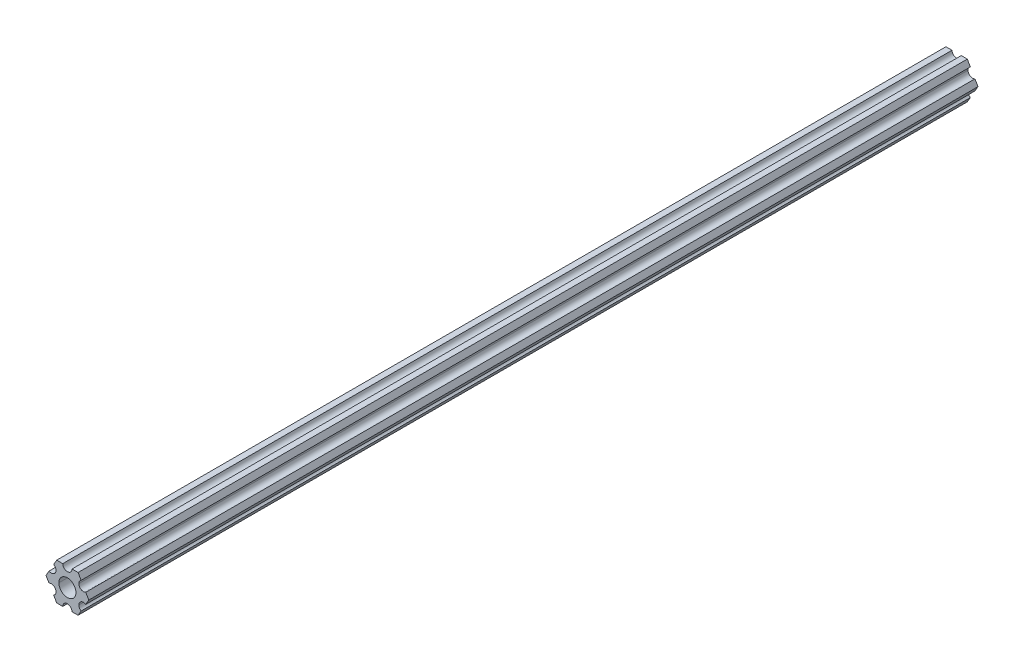
ISO-10303-21;
HEADER;
FILE_DESCRIPTION(('STEP AP214'),'2;1');
FILE_NAME('part.step','',(''),(''),'','','');
FILE_SCHEMA(('AUTOMOTIVE_DESIGN { 1 0 10303 214 1 1 1 1 }'));
ENDSEC;
DATA;
#1=APPLICATION_CONTEXT('core data for automotive mechanical design processes');
#2=APPLICATION_PROTOCOL_DEFINITION('international standard','automotive_design',2000,#1);
#3=PRODUCT_CONTEXT('',#1,'mechanical');
#4=PRODUCT('Part','Part','',(#3));
#5=PRODUCT_RELATED_PRODUCT_CATEGORY('part','',(#4));
#6=PRODUCT_DEFINITION_FORMATION('','',#4);
#7=PRODUCT_DEFINITION_CONTEXT('part definition',#1,'design');
#8=PRODUCT_DEFINITION('design','',#6,#7);
#9=PRODUCT_DEFINITION_SHAPE('','',#8);
#10=(LENGTH_UNIT() NAMED_UNIT(*) SI_UNIT(.MILLI.,.METRE.));
#11=(NAMED_UNIT(*) PLANE_ANGLE_UNIT() SI_UNIT($,.RADIAN.));
#12=(NAMED_UNIT(*) SI_UNIT($,.STERADIAN.) SOLID_ANGLE_UNIT());
#13=UNCERTAINTY_MEASURE_WITH_UNIT(LENGTH_MEASURE(1.E-05),#10,'distance_accuracy_value','');
#14=(GEOMETRIC_REPRESENTATION_CONTEXT(3) GLOBAL_UNCERTAINTY_ASSIGNED_CONTEXT((#13)) GLOBAL_UNIT_ASSIGNED_CONTEXT((#10,
#11,#12)) REPRESENTATION_CONTEXT('',''));
#15=CARTESIAN_POINT('',(0.,0.,0.));
#16=DIRECTION('',(0.,0.,1.));
#17=DIRECTION('',(1.,0.,0.));
#18=AXIS2_PLACEMENT_3D('',#15,#16,#17);
#19=CARTESIAN_POINT('',(0.,0.,304.8));
#20=DIRECTION('',(0.,0.,-1.));
#21=DIRECTION('',(-1.,0.,0.));
#22=AXIS2_PLACEMENT_3D('',#19,#20,#21);
#23=CYLINDRICAL_SURFACE('',#22,2.9337);
#24=DIRECTION('',(0.,0.,-1.));
#25=VECTOR('',#24,1.);
#26=CARTESIAN_POINT('',(2.9337,0.,304.8));
#27=LINE('',#26,#25);
#28=CARTESIAN_POINT('',(2.9337,0.,304.8));
#29=VERTEX_POINT('',#28);
#30=CARTESIAN_POINT('',(2.9337,0.,0.));
#31=VERTEX_POINT('',#30);
#32=EDGE_CURVE('E354',#29,#31,#27,.T.);
#33=ORIENTED_EDGE('',*,*,#32,.F.);
#34=CARTESIAN_POINT('',(0.,0.,304.8));
#35=DIRECTION('',(0.,0.,1.));
#36=DIRECTION('',(1.,0.,0.));
#37=AXIS2_PLACEMENT_3D('',#34,#35,#36);
#38=CIRCLE('',#37,2.9337);
#39=CARTESIAN_POINT('',(-2.9337,0.,304.8));
#40=VERTEX_POINT('',#39);
#41=EDGE_CURVE('E159',#29,#40,#38,.T.);
#42=ORIENTED_EDGE('',*,*,#41,.T.);
#43=DIRECTION('',(0.,0.,-1.));
#44=VECTOR('',#43,1.);
#45=CARTESIAN_POINT('',(-2.9337,0.,304.8));
#46=LINE('',#45,#44);
#47=CARTESIAN_POINT('',(-2.9337,0.,0.));
#48=VERTEX_POINT('',#47);
#49=EDGE_CURVE('E194',#40,#48,#46,.T.);
#50=ORIENTED_EDGE('',*,*,#49,.T.);
#51=CARTESIAN_POINT('',(0.,0.,0.));
#52=DIRECTION('',(0.,0.,1.));
#53=DIRECTION('',(1.,0.,0.));
#54=AXIS2_PLACEMENT_3D('',#51,#52,#53);
#55=CIRCLE('',#54,2.9337);
#56=EDGE_CURVE('E141',#31,#48,#55,.T.);
#57=ORIENTED_EDGE('',*,*,#56,.F.);
#58=EDGE_LOOP('',(#33,#42,#50,#57));
#59=FACE_BOUND('',#58,.T.);
#60=ADVANCED_FACE('F16',(#59),#23,.F.);
#61=CARTESIAN_POINT('',(5.49926150638082,-3.17499966684067,304.8));
#62=DIRECTION('',(0.,0.,-1.));
#63=DIRECTION('',(-1.,0.,0.));
#64=AXIS2_PLACEMENT_3D('',#61,#62,#63);
#65=CYLINDRICAL_SURFACE('',#64,1.5875);
#66=DIRECTION('',(0.,0.,-1.));
#67=VECTOR('',#66,1.);
#68=CARTESIAN_POINT('',(3.91176150638082,-3.17499966684067,304.8));
#69=LINE('',#68,#67);
#70=CARTESIAN_POINT('',(3.91176150638082,-3.17499966684067,304.8));
#71=VERTEX_POINT('',#70);
#72=CARTESIAN_POINT('',(3.91176150638082,-3.17499966684067,0.));
#73=VERTEX_POINT('',#72);
#74=EDGE_CURVE('E204',#71,#73,#69,.T.);
#75=ORIENTED_EDGE('',*,*,#74,.F.);
#76=CARTESIAN_POINT('',(5.49926150638082,-3.17499966684067,304.8));
#77=DIRECTION('',(0.,0.,-1.));
#78=DIRECTION('',(1.,0.,0.));
#79=AXIS2_PLACEMENT_3D('',#76,#77,#78);
#80=CIRCLE('',#79,1.5875);
#81=CARTESIAN_POINT('',(4.70551158967065,-4.54981504343587,304.8));
#82=VERTEX_POINT('',#81);
#83=EDGE_CURVE('E168',#82,#71,#80,.T.);
#84=ORIENTED_EDGE('',*,*,#83,.F.);
#85=DIRECTION('',(0.,0.,-1.));
#86=VECTOR('',#85,1.);
#87=CARTESIAN_POINT('',(4.70551158967065,-4.54981504343587,304.8));
#88=LINE('',#87,#86);
#89=CARTESIAN_POINT('',(4.70551158967065,-4.54981504343587,0.));
#90=VERTEX_POINT('',#89);
#91=EDGE_CURVE('E11',#82,#90,#88,.T.);
#92=ORIENTED_EDGE('',*,*,#91,.T.);
#93=CARTESIAN_POINT('',(5.49926150638082,-3.17499966684067,0.));
#94=DIRECTION('',(0.,0.,-1.));
#95=DIRECTION('',(1.,0.,0.));
#96=AXIS2_PLACEMENT_3D('',#93,#94,#95);
#97=CIRCLE('',#96,1.5875);
#98=EDGE_CURVE('E158',#90,#73,#97,.T.);
#99=ORIENTED_EDGE('',*,*,#98,.T.);
#100=EDGE_LOOP('',(#75,#84,#92,#99));
#101=FACE_BOUND('',#100,.T.);
#102=ADVANCED_FACE('F485',(#101),#65,.F.);
#103=CARTESIAN_POINT('',(3.66617459405346,-6.34999977789375,304.8));
#104=DIRECTION('',(-0.86602543407573,0.499999947533941,0.));
#105=DIRECTION('',(0.,0.,1.));
#106=AXIS2_PLACEMENT_3D('',#103,#104,#105);
#107=PLANE('',#106);
#108=DIRECTION('',(0.499999947533941,0.86602543407573,0.));
#109=VECTOR('',#108,1.);
#110=CARTESIAN_POINT('',(3.66617459405346,-6.34999977789375,0.));
#111=LINE('',#110,#109);
#112=CARTESIAN_POINT('',(3.66617459405346,-6.34999977789375,0.));
#113=VERTEX_POINT('',#112);
#114=EDGE_CURVE('E165',#113,#90,#111,.T.);
#115=ORIENTED_EDGE('',*,*,#114,.T.);
#116=ORIENTED_EDGE('',*,*,#91,.F.);
#117=DIRECTION('',(0.499999947533941,0.86602543407573,0.));
#118=VECTOR('',#117,1.);
#119=CARTESIAN_POINT('',(3.66617459405346,-6.34999977789375,304.8));
#120=LINE('',#119,#118);
#121=CARTESIAN_POINT('',(3.66617459405346,-6.34999977789375,304.8));
#122=VERTEX_POINT('',#121);
#123=EDGE_CURVE('E244',#122,#82,#120,.T.);
#124=ORIENTED_EDGE('',*,*,#123,.F.);
#125=DIRECTION('',(0.,0.,-1.));
#126=VECTOR('',#125,1.);
#127=CARTESIAN_POINT('',(3.66617459405346,-6.34999977789375,304.8));
#128=LINE('',#127,#126);
#129=EDGE_CURVE('E27',#122,#113,#128,.T.);
#130=ORIENTED_EDGE('',*,*,#129,.T.);
#131=EDGE_LOOP('',(#115,#116,#124,#130));
#132=FACE_BOUND('',#131,.T.);
#133=ADVANCED_FACE('F489',(#132),#107,.F.);
#134=CARTESIAN_POINT('',(1.58750038469926,-6.34999990382518,304.8));
#135=DIRECTION('',(-6.05825721258438E-08,1.,0.));
#136=DIRECTION('',(0.,0.,1.));
#137=AXIS2_PLACEMENT_3D('',#134,#135,#136);
#138=PLANE('',#137);
#139=DIRECTION('',(1.,6.05825721258438E-08,0.));
#140=VECTOR('',#139,1.);
#141=CARTESIAN_POINT('',(1.58750038469926,-6.34999990382518,0.));
#142=LINE('',#141,#140);
#143=CARTESIAN_POINT('',(1.58750038469926,-6.34999990382518,0.));
#144=VERTEX_POINT('',#143);
#145=EDGE_CURVE('E171',#144,#113,#142,.T.);
#146=ORIENTED_EDGE('',*,*,#145,.T.);
#147=ORIENTED_EDGE('',*,*,#129,.F.);
#148=DIRECTION('',(1.,6.05825721258438E-08,0.));
#149=VECTOR('',#148,1.);
#150=CARTESIAN_POINT('',(1.58750038469926,-6.34999990382518,304.8));
#151=LINE('',#150,#149);
#152=CARTESIAN_POINT('',(1.58750038469926,-6.34999990382518,304.8));
#153=VERTEX_POINT('',#152);
#154=EDGE_CURVE('E240',#153,#122,#151,.T.);
#155=ORIENTED_EDGE('',*,*,#154,.F.);
#156=DIRECTION('',(0.,0.,-1.));
#157=VECTOR('',#156,1.);
#158=CARTESIAN_POINT('',(1.58750038469926,-6.34999990382518,304.8));
#159=LINE('',#158,#157);
#160=EDGE_CURVE('E202',#153,#144,#159,.T.);
#161=ORIENTED_EDGE('',*,*,#160,.T.);
#162=EDGE_LOOP('',(#146,#147,#155,#161));
#163=FACE_BOUND('',#162,.T.);
#164=ADVANCED_FACE('F492',(#163),#138,.F.);
#165=CARTESIAN_POINT('',(3.8469926204343E-07,-6.35,304.8));
#166=DIRECTION('',(0.,0.,-1.));
#167=DIRECTION('',(-1.,0.,0.));
#168=AXIS2_PLACEMENT_3D('',#165,#166,#167);
#169=CYLINDRICAL_SURFACE('',#168,1.5875);
#170=CARTESIAN_POINT('',(3.8469926204343E-07,-6.35,0.));
#171=DIRECTION('',(0.,0.,-1.));
#172=DIRECTION('',(1.,0.,0.));
#173=AXIS2_PLACEMENT_3D('',#170,#171,#172);
#174=CIRCLE('',#173,1.5875);
#175=CARTESIAN_POINT('',(-1.58749961530073,-6.35000009617482,0.));
#176=VERTEX_POINT('',#175);
#177=EDGE_CURVE('E175',#176,#144,#174,.T.);
#178=ORIENTED_EDGE('',*,*,#177,.T.);
#179=ORIENTED_EDGE('',*,*,#160,.F.);
#180=CARTESIAN_POINT('',(3.8469926204343E-07,-6.35,304.8));
#181=DIRECTION('',(0.,0.,-1.));
#182=DIRECTION('',(1.,0.,0.));
#183=AXIS2_PLACEMENT_3D('',#180,#181,#182);
#184=CIRCLE('',#183,1.5875);
#185=CARTESIAN_POINT('',(-1.58749961530073,-6.35000009617482,304.8));
#186=VERTEX_POINT('',#185);
#187=EDGE_CURVE('E245',#186,#153,#184,.T.);
#188=ORIENTED_EDGE('',*,*,#187,.F.);
#189=DIRECTION('',(0.,0.,-1.));
#190=VECTOR('',#189,1.);
#191=CARTESIAN_POINT('',(-1.58749961530073,-6.35000009617482,304.8));
#192=LINE('',#191,#190);
#193=EDGE_CURVE('E254',#186,#176,#192,.T.);
#194=ORIENTED_EDGE('',*,*,#193,.T.);
#195=EDGE_LOOP('',(#178,#179,#188,#194));
#196=FACE_BOUND('',#195,.T.);
#197=ADVANCED_FACE('F497',(#196),#169,.F.);
#198=CARTESIAN_POINT('',(-3.66617382465481,-6.35000022210628,304.8));
#199=DIRECTION('',(-6.05825854783851E-08,1.,0.));
#200=DIRECTION('',(0.,0.,1.));
#201=AXIS2_PLACEMENT_3D('',#198,#199,#200);
#202=PLANE('',#201);
#203=DIRECTION('',(1.,6.05825854783851E-08,0.));
#204=VECTOR('',#203,1.);
#205=CARTESIAN_POINT('',(-3.66617382465481,-6.35000022210628,0.));
#206=LINE('',#205,#204);
#207=CARTESIAN_POINT('',(-3.66617382465481,-6.35000022210628,0.));
#208=VERTEX_POINT('',#207);
#209=EDGE_CURVE('E266',#208,#176,#206,.T.);
#210=ORIENTED_EDGE('',*,*,#209,.T.);
#211=ORIENTED_EDGE('',*,*,#193,.F.);
#212=DIRECTION('',(1.,6.05825854783851E-08,0.));
#213=VECTOR('',#212,1.);
#214=CARTESIAN_POINT('',(-3.66617382465481,-6.35000022210628,304.8));
#215=LINE('',#214,#213);
#216=CARTESIAN_POINT('',(-3.66617382465481,-6.35000022210628,304.8));
#217=VERTEX_POINT('',#216);
#218=EDGE_CURVE('E250',#217,#186,#215,.T.);
#219=ORIENTED_EDGE('',*,*,#218,.F.);
#220=DIRECTION('',(0.,0.,-1.));
#221=VECTOR('',#220,1.);
#222=CARTESIAN_POINT('',(-3.66617382465481,-6.35000022210628,304.8));
#223=LINE('',#222,#221);
#224=EDGE_CURVE('E258',#217,#208,#223,.T.);
#225=ORIENTED_EDGE('',*,*,#224,.T.);
#226=EDGE_LOOP('',(#210,#211,#219,#225));
#227=FACE_BOUND('',#226,.T.);
#228=ADVANCED_FACE('F502',(#227),#202,.F.);
#229=CARTESIAN_POINT('',(-4.70551103839172,-4.54981561357972,304.8));
#230=DIRECTION('',(0.866025373493152,0.500000052466045,0.));
#231=DIRECTION('',(0.,0.,-1.));
#232=AXIS2_PLACEMENT_3D('',#229,#230,#231);
#233=PLANE('',#232);
#234=DIRECTION('',(0.500000052466045,-0.866025373493152,0.));
#235=VECTOR('',#234,1.);
#236=CARTESIAN_POINT('',(-4.70551103839172,-4.54981561357972,0.));
#237=LINE('',#236,#235);
#238=CARTESIAN_POINT('',(-4.70551103839172,-4.54981561357972,0.));
#239=VERTEX_POINT('',#238);
#240=EDGE_CURVE('E239',#239,#208,#237,.T.);
#241=ORIENTED_EDGE('',*,*,#240,.T.);
#242=ORIENTED_EDGE('',*,*,#224,.F.);
#243=DIRECTION('',(0.500000052466045,-0.866025373493152,0.));
#244=VECTOR('',#243,1.);
#245=CARTESIAN_POINT('',(-4.70551103839172,-4.54981561357972,304.8));
#246=LINE('',#245,#244);
#247=CARTESIAN_POINT('',(-4.70551103839172,-4.54981561357972,304.8));
#248=VERTEX_POINT('',#247);
#249=EDGE_CURVE('E218',#248,#217,#246,.T.);
#250=ORIENTED_EDGE('',*,*,#249,.F.);
#251=DIRECTION('',(0.,0.,-1.));
#252=VECTOR('',#251,1.);
#253=CARTESIAN_POINT('',(-4.70551103839172,-4.54981561357972,304.8));
#254=LINE('',#253,#252);
#255=EDGE_CURVE('E223',#248,#239,#254,.T.);
#256=ORIENTED_EDGE('',*,*,#255,.T.);
#257=EDGE_LOOP('',(#241,#242,#250,#256));
#258=FACE_BOUND('',#257,.T.);
#259=ADVANCED_FACE('F505',(#258),#233,.F.);
#260=CARTESIAN_POINT('',(-5.49926112168156,-3.17500033315934,304.8));
#261=DIRECTION('',(0.,0.,-1.));
#262=DIRECTION('',(-1.,0.,0.));
#263=AXIS2_PLACEMENT_3D('',#260,#261,#262);
#264=CYLINDRICAL_SURFACE('',#263,1.5875);
#265=CARTESIAN_POINT('',(-5.49926112168156,-3.17500033315934,0.));
#266=DIRECTION('',(0.,0.,-1.));
#267=DIRECTION('',(1.,0.,0.));
#268=AXIS2_PLACEMENT_3D('',#265,#266,#267);
#269=CIRCLE('',#268,1.5875);
#270=CARTESIAN_POINT('',(-6.29301120497141,-1.80018505273897,0.));
#271=VERTEX_POINT('',#270);
#272=EDGE_CURVE('E231',#271,#239,#269,.T.);
#273=ORIENTED_EDGE('',*,*,#272,.T.);
#274=ORIENTED_EDGE('',*,*,#255,.F.);
#275=CARTESIAN_POINT('',(-5.49926112168156,-3.17500033315934,304.8));
#276=DIRECTION('',(0.,0.,-1.));
#277=DIRECTION('',(1.,0.,0.));
#278=AXIS2_PLACEMENT_3D('',#275,#276,#277);
#279=CIRCLE('',#278,1.5875);
#280=CARTESIAN_POINT('',(-6.29301120497141,-1.80018505273897,304.8));
#281=VERTEX_POINT('',#280);
#282=EDGE_CURVE('E214',#281,#248,#279,.T.);
#283=ORIENTED_EDGE('',*,*,#282,.F.);
#284=DIRECTION('',(0.,0.,-1.));
#285=VECTOR('',#284,1.);
#286=CARTESIAN_POINT('',(-6.29301120497141,-1.80018505273897,304.8));
#287=LINE('',#286,#285);
#288=EDGE_CURVE('E220',#281,#271,#287,.T.);
#289=ORIENTED_EDGE('',*,*,#288,.T.);
#290=EDGE_LOOP('',(#273,#274,#283,#289));
#291=FACE_BOUND('',#290,.T.);
#292=ADVANCED_FACE('F508',(#291),#264,.F.);
#293=CARTESIAN_POINT('',(-7.33234841870827,-4.44212523790841E-07,304.8));
#294=DIRECTION('',(0.866025373493151,0.500000052466045,0.));
#295=DIRECTION('',(0.,0.,-1.));
#296=AXIS2_PLACEMENT_3D('',#293,#294,#295);
#297=PLANE('',#296);
#298=DIRECTION('',(0.500000052466045,-0.866025373493151,0.));
#299=VECTOR('',#298,1.);
#300=CARTESIAN_POINT('',(-7.33234841870827,-4.44212523790841E-07,0.));
#301=LINE('',#300,#299);
#302=CARTESIAN_POINT('',(-7.33234841870827,-4.44212523790841E-07,0.));
#303=VERTEX_POINT('',#302);
#304=EDGE_CURVE('E226',#303,#271,#301,.T.);
#305=ORIENTED_EDGE('',*,*,#304,.T.);
#306=ORIENTED_EDGE('',*,*,#288,.F.);
#307=DIRECTION('',(0.500000052466045,-0.866025373493151,0.));
#308=VECTOR('',#307,1.);
#309=CARTESIAN_POINT('',(-7.33234841870827,-4.44212523790841E-07,304.8));
#310=LINE('',#309,#308);
#311=CARTESIAN_POINT('',(-7.33234841870827,-4.44212523790841E-07,304.8));
#312=VERTEX_POINT('',#311);
#313=EDGE_CURVE('E219',#312,#281,#310,.T.);
#314=ORIENTED_EDGE('',*,*,#313,.F.);
#315=DIRECTION('',(0.,0.,-1.));
#316=VECTOR('',#315,1.);
#317=CARTESIAN_POINT('',(-7.33234841870827,-4.44212523790841E-07,304.8));
#318=LINE('',#317,#316);
#319=EDGE_CURVE('E224',#312,#303,#318,.T.);
#320=ORIENTED_EDGE('',*,*,#319,.T.);
#321=EDGE_LOOP('',(#305,#306,#314,#320));
#322=FACE_BOUND('',#321,.T.);
#323=ADVANCED_FACE('F513',(#322),#297,.F.);
#324=CARTESIAN_POINT('',(-6.29301142309098,1.80018429024547,304.8));
#325=DIRECTION('',(0.866025434075724,-0.499999947533952,0.));
#326=DIRECTION('',(0.,0.,-1.));
#327=AXIS2_PLACEMENT_3D('',#324,#325,#326);
#328=PLANE('',#327);
#329=DIRECTION('',(-0.499999947533951,-0.866025434075724,0.));
#330=VECTOR('',#329,1.);
#331=CARTESIAN_POINT('',(-6.29301142309098,1.80018429024547,0.));
#332=LINE('',#331,#330);
#333=CARTESIAN_POINT('',(-6.29301142309098,1.80018429024547,0.));
#334=VERTEX_POINT('',#333);
#335=EDGE_CURVE('E230',#334,#303,#332,.T.);
#336=ORIENTED_EDGE('',*,*,#335,.T.);
#337=ORIENTED_EDGE('',*,*,#319,.F.);
#338=DIRECTION('',(-0.499999947533951,-0.866025434075724,0.));
#339=VECTOR('',#338,1.);
#340=CARTESIAN_POINT('',(-6.29301142309098,1.80018429024547,304.8));
#341=LINE('',#340,#339);
#342=CARTESIAN_POINT('',(-6.29301142309098,1.80018429024547,304.8));
#343=VERTEX_POINT('',#342);
#344=EDGE_CURVE('E212',#343,#312,#341,.T.);
#345=ORIENTED_EDGE('',*,*,#344,.F.);
#346=DIRECTION('',(0.,0.,-1.));
#347=VECTOR('',#346,1.);
#348=CARTESIAN_POINT('',(-6.29301142309098,1.80018429024547,304.8));
#349=LINE('',#348,#347);
#350=EDGE_CURVE('E20',#343,#334,#349,.T.);
#351=ORIENTED_EDGE('',*,*,#350,.T.);
#352=EDGE_LOOP('',(#336,#337,#345,#351));
#353=FACE_BOUND('',#352,.T.);
#354=ADVANCED_FACE('F514',(#353),#328,.F.);
#355=CARTESIAN_POINT('',(-5.49926150638082,3.17499966684067,304.8));
#356=DIRECTION('',(0.,0.,-1.));
#357=DIRECTION('',(-1.,0.,0.));
#358=AXIS2_PLACEMENT_3D('',#355,#356,#357);
#359=CYLINDRICAL_SURFACE('',#358,1.5875);
#360=CARTESIAN_POINT('',(-5.49926150638082,3.17499966684067,0.));
#361=DIRECTION('',(0.,0.,-1.));
#362=DIRECTION('',(1.,0.,0.));
#363=AXIS2_PLACEMENT_3D('',#360,#361,#362);
#364=CIRCLE('',#363,1.5875);
#365=CARTESIAN_POINT('',(-4.70551158967065,4.54981504343587,0.));
#366=VERTEX_POINT('',#365);
#367=EDGE_CURVE('E280',#366,#334,#364,.T.);
#368=ORIENTED_EDGE('',*,*,#367,.T.);
#369=ORIENTED_EDGE('',*,*,#350,.F.);
#370=CARTESIAN_POINT('',(-5.49926150638082,3.17499966684067,304.8));
#371=DIRECTION('',(0.,0.,-1.));
#372=DIRECTION('',(1.,0.,0.));
#373=AXIS2_PLACEMENT_3D('',#370,#371,#372);
#374=CIRCLE('',#373,1.5875);
#375=CARTESIAN_POINT('',(-4.70551158967065,4.54981504343587,304.8));
#376=VERTEX_POINT('',#375);
#377=EDGE_CURVE('E208',#376,#343,#374,.T.);
#378=ORIENTED_EDGE('',*,*,#377,.F.);
#379=DIRECTION('',(0.,0.,-1.));
#380=VECTOR('',#379,1.);
#381=CARTESIAN_POINT('',(-4.70551158967065,4.54981504343587,304.8));
#382=LINE('',#381,#380);
#383=EDGE_CURVE('E307',#376,#366,#382,.T.);
#384=ORIENTED_EDGE('',*,*,#383,.T.);
#385=EDGE_LOOP('',(#368,#369,#378,#384));
#386=FACE_BOUND('',#385,.T.);
#387=ADVANCED_FACE('F409',(#386),#359,.F.);
#388=CARTESIAN_POINT('',(-3.66617459405349,6.3499997778937,304.8));
#389=DIRECTION('',(0.866025434075729,-0.499999947533942,0.));
#390=DIRECTION('',(0.,0.,-1.));
#391=AXIS2_PLACEMENT_3D('',#388,#389,#390);
#392=PLANE('',#391);
#393=DIRECTION('',(-0.499999947533943,-0.866025434075729,0.));
#394=VECTOR('',#393,1.);
#395=CARTESIAN_POINT('',(-3.66617459405349,6.3499997778937,0.));
#396=LINE('',#395,#394);
#397=CARTESIAN_POINT('',(-3.66617459405349,6.3499997778937,0.));
#398=VERTEX_POINT('',#397);
#399=EDGE_CURVE('E275',#398,#366,#396,.T.);
#400=ORIENTED_EDGE('',*,*,#399,.T.);
#401=ORIENTED_EDGE('',*,*,#383,.F.);
#402=DIRECTION('',(-0.499999947533943,-0.866025434075729,0.));
#403=VECTOR('',#402,1.);
#404=CARTESIAN_POINT('',(-3.66617459405349,6.3499997778937,304.8));
#405=LINE('',#404,#403);
#406=CARTESIAN_POINT('',(-3.66617459405349,6.3499997778937,304.8));
#407=VERTEX_POINT('',#406);
#408=EDGE_CURVE('E213',#407,#376,#405,.T.);
#409=ORIENTED_EDGE('',*,*,#408,.F.);
#410=DIRECTION('',(0.,0.,-1.));
#411=VECTOR('',#410,1.);
#412=CARTESIAN_POINT('',(-3.66617459405349,6.3499997778937,304.8));
#413=LINE('',#412,#411);
#414=EDGE_CURVE('E303',#407,#398,#413,.T.);
#415=ORIENTED_EDGE('',*,*,#414,.T.);
#416=EDGE_LOOP('',(#400,#401,#409,#415));
#417=FACE_BOUND('',#416,.T.);
#418=ADVANCED_FACE('F390',(#417),#392,.F.);
#419=CARTESIAN_POINT('',(-1.58750038469926,6.34999990382518,304.8));
#420=DIRECTION('',(6.05825963273174E-08,-1.,0.));
#421=DIRECTION('',(0.,0.,-1.));
#422=AXIS2_PLACEMENT_3D('',#419,#420,#421);
#423=PLANE('',#422);
#424=DIRECTION('',(-1.,-6.05825963273174E-08,0.));
#425=VECTOR('',#424,1.);
#426=CARTESIAN_POINT('',(-1.58750038469926,6.34999990382518,0.));
#427=LINE('',#426,#425);
#428=CARTESIAN_POINT('',(-1.58750038469926,6.34999990382519,0.));
#429=VERTEX_POINT('',#428);
#430=EDGE_CURVE('E279',#429,#398,#427,.T.);
#431=ORIENTED_EDGE('',*,*,#430,.T.);
#432=ORIENTED_EDGE('',*,*,#414,.F.);
#433=DIRECTION('',(-1.,-6.05825963273174E-08,0.));
#434=VECTOR('',#433,1.);
#435=CARTESIAN_POINT('',(-1.58750038469926,6.34999990382518,304.8));
#436=LINE('',#435,#434);
#437=CARTESIAN_POINT('',(-1.58750038469926,6.34999990382519,304.8));
#438=VERTEX_POINT('',#437);
#439=EDGE_CURVE('E292',#438,#407,#436,.T.);
#440=ORIENTED_EDGE('',*,*,#439,.F.);
#441=DIRECTION('',(0.,0.,-1.));
#442=VECTOR('',#441,1.);
#443=CARTESIAN_POINT('',(-1.58750038469926,6.34999990382519,304.8));
#444=LINE('',#443,#442);
#445=EDGE_CURVE('E274',#438,#429,#444,.T.);
#446=ORIENTED_EDGE('',*,*,#445,.T.);
#447=EDGE_LOOP('',(#431,#432,#440,#446));
#448=FACE_BOUND('',#447,.T.);
#449=ADVANCED_FACE('F400',(#448),#423,.F.);
#450=CARTESIAN_POINT('',(-3.84699260060323E-07,6.35,304.8));
#451=DIRECTION('',(0.,0.,-1.));
#452=DIRECTION('',(-1.,0.,0.));
#453=AXIS2_PLACEMENT_3D('',#450,#451,#452);
#454=CYLINDRICAL_SURFACE('',#453,1.5875);
#455=CARTESIAN_POINT('',(-3.84699260060323E-07,6.35,0.));
#456=DIRECTION('',(0.,0.,-1.));
#457=DIRECTION('',(1.,0.,0.));
#458=AXIS2_PLACEMENT_3D('',#455,#456,#457);
#459=CIRCLE('',#458,1.5875);
#460=CARTESIAN_POINT('',(1.58749961530074,6.35000009617482,0.));
#461=VERTEX_POINT('',#460);
#462=EDGE_CURVE('E249',#461,#429,#459,.T.);
#463=ORIENTED_EDGE('',*,*,#462,.T.);
#464=ORIENTED_EDGE('',*,*,#445,.F.);
#465=CARTESIAN_POINT('',(-3.84699260060323E-07,6.35,304.8));
#466=DIRECTION('',(0.,0.,-1.));
#467=DIRECTION('',(1.,0.,0.));
#468=AXIS2_PLACEMENT_3D('',#465,#466,#467);
#469=CIRCLE('',#468,1.5875);
#470=CARTESIAN_POINT('',(1.58749961530074,6.35000009617482,304.8));
#471=VERTEX_POINT('',#470);
#472=EDGE_CURVE('E183',#471,#438,#469,.T.);
#473=ORIENTED_EDGE('',*,*,#472,.F.);
#474=DIRECTION('',(0.,0.,-1.));
#475=VECTOR('',#474,1.);
#476=CARTESIAN_POINT('',(1.58749961530074,6.35000009617482,304.8));
#477=LINE('',#476,#475);
#478=EDGE_CURVE('E235',#471,#461,#477,.T.);
#479=ORIENTED_EDGE('',*,*,#478,.T.);
#480=EDGE_LOOP('',(#463,#464,#473,#479));
#481=FACE_BOUND('',#480,.T.);
#482=ADVANCED_FACE('F547',(#481),#454,.F.);
#483=CARTESIAN_POINT('',(3.66617382465481,6.35000022210627,304.8));
#484=DIRECTION('',(6.05825850611185E-08,-1.,0.));
#485=DIRECTION('',(0.,0.,-1.));
#486=AXIS2_PLACEMENT_3D('',#483,#484,#485);
#487=PLANE('',#486);
#488=DIRECTION('',(-1.,-6.05825850611185E-08,0.));
#489=VECTOR('',#488,1.);
#490=CARTESIAN_POINT('',(3.66617382465481,6.35000022210627,0.));
#491=LINE('',#490,#489);
#492=CARTESIAN_POINT('',(3.66617382465481,6.35000022210627,0.));
#493=VERTEX_POINT('',#492);
#494=EDGE_CURVE('E193',#493,#461,#491,.T.);
#495=ORIENTED_EDGE('',*,*,#494,.T.);
#496=ORIENTED_EDGE('',*,*,#478,.F.);
#497=DIRECTION('',(-1.,-6.05825850611185E-08,0.));
#498=VECTOR('',#497,1.);
#499=CARTESIAN_POINT('',(3.66617382465481,6.35000022210627,304.8));
#500=LINE('',#499,#498);
#501=CARTESIAN_POINT('',(3.66617382465481,6.35000022210627,304.8));
#502=VERTEX_POINT('',#501);
#503=EDGE_CURVE('E179',#502,#471,#500,.T.);
#504=ORIENTED_EDGE('',*,*,#503,.F.);
#505=DIRECTION('',(0.,0.,-1.));
#506=VECTOR('',#505,1.);
#507=CARTESIAN_POINT('',(3.66617382465481,6.35000022210627,304.8));
#508=LINE('',#507,#506);
#509=EDGE_CURVE('E232',#502,#493,#508,.T.);
#510=ORIENTED_EDGE('',*,*,#509,.T.);
#511=EDGE_LOOP('',(#495,#496,#504,#510));
#512=FACE_BOUND('',#511,.T.);
#513=ADVANCED_FACE('F560',(#512),#487,.F.);
#514=CARTESIAN_POINT('',(4.70551103839172,4.54981561357972,304.8));
#515=DIRECTION('',(-0.866025373493151,-0.500000052466046,0.));
#516=DIRECTION('',(-0.500000052466046,0.866025373493151,0.));
#517=AXIS2_PLACEMENT_3D('',#514,#515,#516);
#518=PLANE('',#517);
#519=DIRECTION('',(-0.500000052466046,0.866025373493151,0.));
#520=VECTOR('',#519,1.);
#521=CARTESIAN_POINT('',(4.70551103839172,4.54981561357972,0.));
#522=LINE('',#521,#520);
#523=CARTESIAN_POINT('',(4.70551103839172,4.54981561357972,0.));
#524=VERTEX_POINT('',#523);
#525=EDGE_CURVE('E189',#524,#493,#522,.T.);
#526=ORIENTED_EDGE('',*,*,#525,.T.);
#527=ORIENTED_EDGE('',*,*,#509,.F.);
#528=DIRECTION('',(-0.500000052466046,0.866025373493151,0.));
#529=VECTOR('',#528,1.);
#530=CARTESIAN_POINT('',(4.70551103839172,4.54981561357972,304.8));
#531=LINE('',#530,#529);
#532=CARTESIAN_POINT('',(4.70551103839172,4.54981561357972,304.8));
#533=VERTEX_POINT('',#532);
#534=EDGE_CURVE('E184',#533,#502,#531,.T.);
#535=ORIENTED_EDGE('',*,*,#534,.F.);
#536=DIRECTION('',(0.,0.,-1.));
#537=VECTOR('',#536,1.);
#538=CARTESIAN_POINT('',(4.70551103839172,4.54981561357972,304.8));
#539=LINE('',#538,#537);
#540=EDGE_CURVE('E288',#533,#524,#539,.T.);
#541=ORIENTED_EDGE('',*,*,#540,.T.);
#542=EDGE_LOOP('',(#526,#527,#535,#541));
#543=FACE_BOUND('',#542,.T.);
#544=ADVANCED_FACE('F538',(#543),#518,.F.);
#545=CARTESIAN_POINT('',(5.49926112168156,3.17500033315934,304.8));
#546=DIRECTION('',(0.,0.,-1.));
#547=DIRECTION('',(-1.,0.,0.));
#548=AXIS2_PLACEMENT_3D('',#545,#546,#547);
#549=CYLINDRICAL_SURFACE('',#548,1.5875);
#550=DIRECTION('',(0.,0.,-1.));
#551=VECTOR('',#550,1.);
#552=CARTESIAN_POINT('',(3.91176112168156,3.17500033315934,304.8));
#553=LINE('',#552,#551);
#554=CARTESIAN_POINT('',(3.91176112168156,3.17500033315934,304.8));
#555=VERTEX_POINT('',#554);
#556=CARTESIAN_POINT('',(3.91176112168156,3.17500033315934,0.));
#557=VERTEX_POINT('',#556);
#558=EDGE_CURVE('E296',#555,#557,#553,.T.);
#559=ORIENTED_EDGE('',*,*,#558,.F.);
#560=CARTESIAN_POINT('',(5.49926112168156,3.17500033315934,304.8));
#561=DIRECTION('',(0.,0.,-1.));
#562=DIRECTION('',(1.,0.,0.));
#563=AXIS2_PLACEMENT_3D('',#560,#561,#562);
#564=CIRCLE('',#563,1.5875);
#565=CARTESIAN_POINT('',(6.29301120497139,1.80018505273894,304.8));
#566=VERTEX_POINT('',#565);
#567=EDGE_CURVE('E265',#566,#555,#564,.T.);
#568=ORIENTED_EDGE('',*,*,#567,.F.);
#569=DIRECTION('',(0.,0.,-1.));
#570=VECTOR('',#569,1.);
#571=CARTESIAN_POINT('',(6.29301120497139,1.80018505273894,304.8));
#572=LINE('',#571,#570);
#573=CARTESIAN_POINT('',(6.29301120497139,1.80018505273894,0.));
#574=VERTEX_POINT('',#573);
#575=EDGE_CURVE('E42',#566,#574,#572,.T.);
#576=ORIENTED_EDGE('',*,*,#575,.T.);
#577=CARTESIAN_POINT('',(5.49926112168156,3.17500033315934,0.));
#578=DIRECTION('',(0.,0.,-1.));
#579=DIRECTION('',(1.,0.,0.));
#580=AXIS2_PLACEMENT_3D('',#577,#578,#579);
#581=CIRCLE('',#580,1.5875);
#582=EDGE_CURVE('E150',#574,#557,#581,.T.);
#583=ORIENTED_EDGE('',*,*,#582,.T.);
#584=EDGE_LOOP('',(#559,#568,#576,#583));
#585=FACE_BOUND('',#584,.T.);
#586=ADVANCED_FACE('F473',(#585),#549,.F.);
#587=CARTESIAN_POINT('',(7.33234841870827,4.44212519169686E-07,304.8));
#588=DIRECTION('',(-0.866025373493145,-0.500000052466057,0.));
#589=DIRECTION('',(-0.500000052466057,0.866025373493145,0.));
#590=AXIS2_PLACEMENT_3D('',#587,#588,#589);
#591=PLANE('',#590);
#592=DIRECTION('',(-0.500000052466056,0.866025373493145,0.));
#593=VECTOR('',#592,1.);
#594=CARTESIAN_POINT('',(7.33234841870827,4.44212519169686E-07,0.));
#595=LINE('',#594,#593);
#596=CARTESIAN_POINT('',(7.33234841870827,4.44212519169686E-07,0.));
#597=VERTEX_POINT('',#596);
#598=EDGE_CURVE('E132',#597,#574,#595,.T.);
#599=ORIENTED_EDGE('',*,*,#598,.T.);
#600=ORIENTED_EDGE('',*,*,#575,.F.);
#601=DIRECTION('',(-0.500000052466056,0.866025373493145,0.));
#602=VECTOR('',#601,1.);
#603=CARTESIAN_POINT('',(7.33234841870827,4.44212519169686E-07,304.8));
#604=LINE('',#603,#602);
#605=CARTESIAN_POINT('',(7.33234841870827,4.44212519169686E-07,304.8));
#606=VERTEX_POINT('',#605);
#607=EDGE_CURVE('E135',#606,#566,#604,.T.);
#608=ORIENTED_EDGE('',*,*,#607,.F.);
#609=DIRECTION('',(0.,0.,-1.));
#610=VECTOR('',#609,1.);
#611=CARTESIAN_POINT('',(7.33234841870827,4.44212519169686E-07,304.8));
#612=LINE('',#611,#610);
#613=EDGE_CURVE('E129',#606,#597,#612,.T.);
#614=ORIENTED_EDGE('',*,*,#613,.T.);
#615=EDGE_LOOP('',(#599,#600,#608,#614));
#616=FACE_BOUND('',#615,.T.);
#617=ADVANCED_FACE('F131',(#616),#591,.F.);
#618=CARTESIAN_POINT('',(6.29301142309098,-1.80018429024546,304.8));
#619=DIRECTION('',(-0.866025434075723,0.499999947533953,0.));
#620=DIRECTION('',(0.,0.,1.));
#621=AXIS2_PLACEMENT_3D('',#618,#619,#620);
#622=PLANE('',#621);
#623=DIRECTION('',(0.499999947533953,0.866025434075723,0.));
#624=VECTOR('',#623,1.);
#625=CARTESIAN_POINT('',(6.29301142309098,-1.80018429024546,0.));
#626=LINE('',#625,#624);
#627=CARTESIAN_POINT('',(6.29301142309098,-1.80018429024546,0.));
#628=VERTEX_POINT('',#627);
#629=EDGE_CURVE('E147',#628,#597,#626,.T.);
#630=ORIENTED_EDGE('',*,*,#629,.T.);
#631=ORIENTED_EDGE('',*,*,#613,.F.);
#632=DIRECTION('',(0.499999947533953,0.866025434075723,0.));
#633=VECTOR('',#632,1.);
#634=CARTESIAN_POINT('',(6.29301142309098,-1.80018429024546,304.8));
#635=LINE('',#634,#633);
#636=CARTESIAN_POINT('',(6.29301142309098,-1.80018429024546,304.8));
#637=VERTEX_POINT('',#636);
#638=EDGE_CURVE('E285',#637,#606,#635,.T.);
#639=ORIENTED_EDGE('',*,*,#638,.F.);
#640=DIRECTION('',(0.,0.,-1.));
#641=VECTOR('',#640,1.);
#642=CARTESIAN_POINT('',(6.29301142309098,-1.80018429024546,304.8));
#643=LINE('',#642,#641);
#644=EDGE_CURVE('E155',#637,#628,#643,.T.);
#645=ORIENTED_EDGE('',*,*,#644,.T.);
#646=EDGE_LOOP('',(#630,#631,#639,#645));
#647=FACE_BOUND('',#646,.T.);
#648=ADVANCED_FACE('F153',(#647),#622,.F.);
#649=CARTESIAN_POINT('',(5.49926112168156,3.17500033315934,0.));
#650=DIRECTION('',(0.,0.,1.));
#651=DIRECTION('',(1.,0.,0.));
#652=AXIS2_PLACEMENT_3D('',#649,#650,#651);
#653=PLANE('',#652);
#654=CARTESIAN_POINT('',(0.,0.,0.));
#655=DIRECTION('',(0.,0.,1.));
#656=DIRECTION('',(1.,0.,0.));
#657=AXIS2_PLACEMENT_3D('',#654,#655,#656);
#658=CIRCLE('',#657,2.9337);
#659=EDGE_CURVE('E199',#48,#31,#658,.T.);
#660=ORIENTED_EDGE('',*,*,#659,.T.);
#661=ORIENTED_EDGE('',*,*,#56,.T.);
#662=EDGE_LOOP('',(#660,#661));
#663=FACE_BOUND('',#662,.T.);
#664=ORIENTED_EDGE('',*,*,#629,.F.);
#665=CARTESIAN_POINT('',(5.49926150638082,-3.17499966684067,0.));
#666=DIRECTION('',(0.,0.,-1.));
#667=DIRECTION('',(1.,0.,0.));
#668=AXIS2_PLACEMENT_3D('',#665,#666,#667);
#669=CIRCLE('',#668,1.5875);
#670=EDGE_CURVE('E188',#73,#628,#669,.T.);
#671=ORIENTED_EDGE('',*,*,#670,.F.);
#672=ORIENTED_EDGE('',*,*,#98,.F.);
#673=ORIENTED_EDGE('',*,*,#114,.F.);
#674=ORIENTED_EDGE('',*,*,#145,.F.);
#675=ORIENTED_EDGE('',*,*,#177,.F.);
#676=ORIENTED_EDGE('',*,*,#209,.F.);
#677=ORIENTED_EDGE('',*,*,#240,.F.);
#678=ORIENTED_EDGE('',*,*,#272,.F.);
#679=ORIENTED_EDGE('',*,*,#304,.F.);
#680=ORIENTED_EDGE('',*,*,#335,.F.);
#681=ORIENTED_EDGE('',*,*,#367,.F.);
#682=ORIENTED_EDGE('',*,*,#399,.F.);
#683=ORIENTED_EDGE('',*,*,#430,.F.);
#684=ORIENTED_EDGE('',*,*,#462,.F.);
#685=ORIENTED_EDGE('',*,*,#494,.F.);
#686=ORIENTED_EDGE('',*,*,#525,.F.);
#687=CARTESIAN_POINT('',(5.49926112168156,3.17500033315934,0.));
#688=DIRECTION('',(0.,0.,-1.));
#689=DIRECTION('',(1.,0.,0.));
#690=AXIS2_PLACEMENT_3D('',#687,#688,#689);
#691=CIRCLE('',#690,1.5875);
#692=EDGE_CURVE('E317',#557,#524,#691,.T.);
#693=ORIENTED_EDGE('',*,*,#692,.F.);
#694=ORIENTED_EDGE('',*,*,#582,.F.);
#695=ORIENTED_EDGE('',*,*,#598,.F.);
#696=EDGE_LOOP('',(#664,#671,#672,#673,#674,#675,#676,#677,#678,#679,#680,#681,#682,#683,#684,
#685,#686,#693,#694,#695));
#697=FACE_BOUND('',#696,.T.);
#698=ADVANCED_FACE('F145',(#663,#697),#653,.F.);
#699=CARTESIAN_POINT('',(5.49926112168156,3.17500033315934,304.8));
#700=DIRECTION('',(0.,0.,1.));
#701=DIRECTION('',(1.,0.,0.));
#702=AXIS2_PLACEMENT_3D('',#699,#700,#701);
#703=PLANE('',#702);
#704=CARTESIAN_POINT('',(0.,0.,304.8));
#705=DIRECTION('',(0.,0.,1.));
#706=DIRECTION('',(1.,0.,0.));
#707=AXIS2_PLACEMENT_3D('',#704,#705,#706);
#708=CIRCLE('',#707,2.9337);
#709=EDGE_CURVE('E350',#40,#29,#708,.T.);
#710=ORIENTED_EDGE('',*,*,#709,.F.);
#711=ORIENTED_EDGE('',*,*,#41,.F.);
#712=EDGE_LOOP('',(#710,#711));
#713=FACE_BOUND('',#712,.T.);
#714=ORIENTED_EDGE('',*,*,#638,.T.);
#715=ORIENTED_EDGE('',*,*,#607,.T.);
#716=ORIENTED_EDGE('',*,*,#567,.T.);
#717=CARTESIAN_POINT('',(5.49926112168156,3.17500033315934,304.8));
#718=DIRECTION('',(0.,0.,-1.));
#719=DIRECTION('',(1.,0.,0.));
#720=AXIS2_PLACEMENT_3D('',#717,#718,#719);
#721=CIRCLE('',#720,1.5875);
#722=EDGE_CURVE('E187',#555,#533,#721,.T.);
#723=ORIENTED_EDGE('',*,*,#722,.T.);
#724=ORIENTED_EDGE('',*,*,#534,.T.);
#725=ORIENTED_EDGE('',*,*,#503,.T.);
#726=ORIENTED_EDGE('',*,*,#472,.T.);
#727=ORIENTED_EDGE('',*,*,#439,.T.);
#728=ORIENTED_EDGE('',*,*,#408,.T.);
#729=ORIENTED_EDGE('',*,*,#377,.T.);
#730=ORIENTED_EDGE('',*,*,#344,.T.);
#731=ORIENTED_EDGE('',*,*,#313,.T.);
#732=ORIENTED_EDGE('',*,*,#282,.T.);
#733=ORIENTED_EDGE('',*,*,#249,.T.);
#734=ORIENTED_EDGE('',*,*,#218,.T.);
#735=ORIENTED_EDGE('',*,*,#187,.T.);
#736=ORIENTED_EDGE('',*,*,#154,.T.);
#737=ORIENTED_EDGE('',*,*,#123,.T.);
#738=ORIENTED_EDGE('',*,*,#83,.T.);
#739=CARTESIAN_POINT('',(5.49926150638082,-3.17499966684067,304.8));
#740=DIRECTION('',(0.,0.,-1.));
#741=DIRECTION('',(1.,0.,0.));
#742=AXIS2_PLACEMENT_3D('',#739,#740,#741);
#743=CIRCLE('',#742,1.5875);
#744=EDGE_CURVE('E198',#71,#637,#743,.T.);
#745=ORIENTED_EDGE('',*,*,#744,.T.);
#746=EDGE_LOOP('',(#714,#715,#716,#723,#724,#725,#726,#727,#728,#729,#730,#731,#732,#733,#734,
#735,#736,#737,#738,#745));
#747=FACE_BOUND('',#746,.T.);
#748=ADVANCED_FACE('F476',(#713,#747),#703,.T.);
#749=CARTESIAN_POINT('',(5.49926112168156,3.17500033315934,304.8));
#750=DIRECTION('',(0.,0.,-1.));
#751=DIRECTION('',(-1.,0.,0.));
#752=AXIS2_PLACEMENT_3D('',#749,#750,#751);
#753=CYLINDRICAL_SURFACE('',#752,1.5875);
#754=ORIENTED_EDGE('',*,*,#722,.F.);
#755=ORIENTED_EDGE('',*,*,#558,.T.);
#756=ORIENTED_EDGE('',*,*,#692,.T.);
#757=ORIENTED_EDGE('',*,*,#540,.F.);
#758=EDGE_LOOP('',(#754,#755,#756,#757));
#759=FACE_BOUND('',#758,.T.);
#760=ADVANCED_FACE('F552',(#759),#753,.F.);
#761=CARTESIAN_POINT('',(5.49926150638082,-3.17499966684067,304.8));
#762=DIRECTION('',(0.,0.,-1.));
#763=DIRECTION('',(-1.,0.,0.));
#764=AXIS2_PLACEMENT_3D('',#761,#762,#763);
#765=CYLINDRICAL_SURFACE('',#764,1.5875);
#766=ORIENTED_EDGE('',*,*,#744,.F.);
#767=ORIENTED_EDGE('',*,*,#74,.T.);
#768=ORIENTED_EDGE('',*,*,#670,.T.);
#769=ORIENTED_EDGE('',*,*,#644,.F.);
#770=EDGE_LOOP('',(#766,#767,#768,#769));
#771=FACE_BOUND('',#770,.T.);
#772=ADVANCED_FACE('F479',(#771),#765,.F.);
#773=CARTESIAN_POINT('',(0.,0.,304.8));
#774=DIRECTION('',(0.,0.,-1.));
#775=DIRECTION('',(-1.,0.,0.));
#776=AXIS2_PLACEMENT_3D('',#773,#774,#775);
#777=CYLINDRICAL_SURFACE('',#776,2.9337);
#778=ORIENTED_EDGE('',*,*,#709,.T.);
#779=ORIENTED_EDGE('',*,*,#32,.T.);
#780=ORIENTED_EDGE('',*,*,#659,.F.);
#781=ORIENTED_EDGE('',*,*,#49,.F.);
#782=EDGE_LOOP('',(#778,#779,#780,#781));
#783=FACE_BOUND('',#782,.T.);
#784=ADVANCED_FACE('F18',(#783),#777,.F.);
#785=CLOSED_SHELL('',(#60,#102,#133,#164,#197,#228,#259,#292,#323,#354,#387,#418,#449,#482,#513,
#544,#586,#617,#648,#698,#748,#760,#772,#784));
#786=MANIFOLD_SOLID_BREP('B1',#785);
#787=ADVANCED_BREP_SHAPE_REPRESENTATION('',(#18,#786),#14);
#788=SHAPE_DEFINITION_REPRESENTATION(#9,#787);
ENDSEC;
END-ISO-10303-21;
